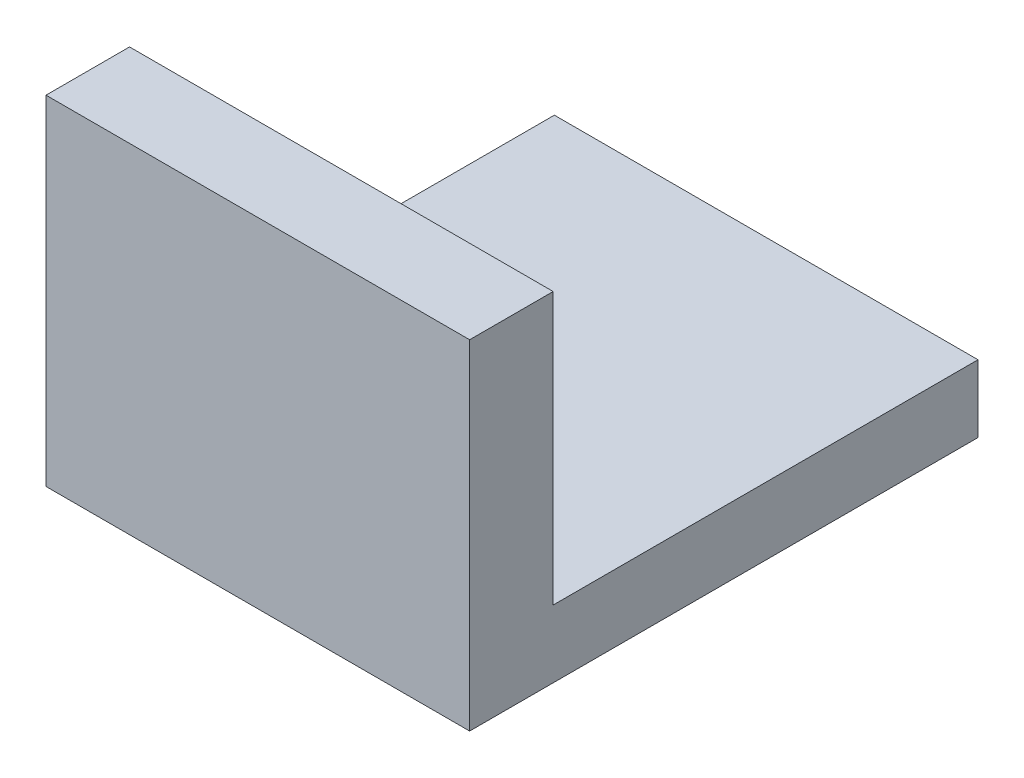
ISO-10303-21;
HEADER;
FILE_DESCRIPTION(('STEP AP214'),'2;1');
FILE_NAME('part.step','',(''),(''),'','','');
FILE_SCHEMA(('AUTOMOTIVE_DESIGN { 1 0 10303 214 1 1 1 1 }'));
ENDSEC;
DATA;
#1=APPLICATION_CONTEXT('core data for automotive mechanical design processes');
#2=APPLICATION_PROTOCOL_DEFINITION('international standard','automotive_design',2000,#1);
#3=PRODUCT_CONTEXT('',#1,'mechanical');
#4=PRODUCT('Part','Part','',(#3));
#5=PRODUCT_RELATED_PRODUCT_CATEGORY('part','',(#4));
#6=PRODUCT_DEFINITION_FORMATION('','',#4);
#7=PRODUCT_DEFINITION_CONTEXT('part definition',#1,'design');
#8=PRODUCT_DEFINITION('design','',#6,#7);
#9=PRODUCT_DEFINITION_SHAPE('','',#8);
#10=(LENGTH_UNIT() NAMED_UNIT(*) SI_UNIT(.MILLI.,.METRE.));
#11=(NAMED_UNIT(*) PLANE_ANGLE_UNIT() SI_UNIT($,.RADIAN.));
#12=(NAMED_UNIT(*) SI_UNIT($,.STERADIAN.) SOLID_ANGLE_UNIT());
#13=UNCERTAINTY_MEASURE_WITH_UNIT(LENGTH_MEASURE(1.E-05),#10,'distance_accuracy_value','');
#14=(GEOMETRIC_REPRESENTATION_CONTEXT(3) GLOBAL_UNCERTAINTY_ASSIGNED_CONTEXT((#13)) GLOBAL_UNIT_ASSIGNED_CONTEXT((#10,
#11,#12)) REPRESENTATION_CONTEXT('',''));
#15=CARTESIAN_POINT('',(0.,0.,0.));
#16=DIRECTION('',(0.,0.,1.));
#17=DIRECTION('',(1.,0.,0.));
#18=AXIS2_PLACEMENT_3D('',#15,#16,#17);
#19=CARTESIAN_POINT('',(127.,0.,0.));
#20=DIRECTION('',(0.,1.,0.));
#21=DIRECTION('',(0.,0.,1.));
#22=AXIS2_PLACEMENT_3D('',#19,#20,#21);
#23=PLANE('',#22);
#24=DIRECTION('',(0.,0.,-1.));
#25=VECTOR('',#24,1.);
#26=CARTESIAN_POINT('',(0.,0.,0.));
#27=LINE('',#26,#25);
#28=CARTESIAN_POINT('',(0.,0.,0.));
#29=VERTEX_POINT('',#28);
#30=CARTESIAN_POINT('',(0.,0.,-152.4));
#31=VERTEX_POINT('',#30);
#32=EDGE_CURVE('E117',#29,#31,#27,.T.);
#33=ORIENTED_EDGE('',*,*,#32,.T.);
#34=DIRECTION('',(-1.,0.,0.));
#35=VECTOR('',#34,1.);
#36=CARTESIAN_POINT('',(127.,0.,-152.4));
#37=LINE('',#36,#35);
#38=CARTESIAN_POINT('',(127.,0.,-152.4));
#39=VERTEX_POINT('',#38);
#40=EDGE_CURVE('E11',#39,#31,#37,.T.);
#41=ORIENTED_EDGE('',*,*,#40,.F.);
#42=DIRECTION('',(0.,0.,-1.));
#43=VECTOR('',#42,1.);
#44=CARTESIAN_POINT('',(127.,0.,0.));
#45=LINE('',#44,#43);
#46=CARTESIAN_POINT('',(127.,0.,0.));
#47=VERTEX_POINT('',#46);
#48=EDGE_CURVE('E127',#47,#39,#45,.T.);
#49=ORIENTED_EDGE('',*,*,#48,.F.);
#50=DIRECTION('',(-1.,0.,0.));
#51=VECTOR('',#50,1.);
#52=CARTESIAN_POINT('',(127.,0.,0.));
#53=LINE('',#52,#51);
#54=EDGE_CURVE('E113',#47,#29,#53,.T.);
#55=ORIENTED_EDGE('',*,*,#54,.T.);
#56=EDGE_LOOP('',(#33,#41,#49,#55));
#57=FACE_BOUND('',#56,.T.);
#58=ADVANCED_FACE('F33',(#57),#23,.F.);
#59=CARTESIAN_POINT('',(127.,0.,-152.4));
#60=DIRECTION('',(0.,0.,1.));
#61=DIRECTION('',(1.,0.,0.));
#62=AXIS2_PLACEMENT_3D('',#59,#60,#61);
#63=PLANE('',#62);
#64=DIRECTION('',(0.,1.,0.));
#65=VECTOR('',#64,1.);
#66=CARTESIAN_POINT('',(0.,0.,-152.4));
#67=LINE('',#66,#65);
#68=CARTESIAN_POINT('',(0.,20.2063995162138,-152.4));
#69=VERTEX_POINT('',#68);
#70=EDGE_CURVE('E120',#31,#69,#67,.T.);
#71=ORIENTED_EDGE('',*,*,#70,.T.);
#72=DIRECTION('',(-1.,0.,0.));
#73=VECTOR('',#72,1.);
#74=CARTESIAN_POINT('',(127.,20.2063995162138,-152.4));
#75=LINE('',#74,#73);
#76=CARTESIAN_POINT('',(127.,20.2063995162138,-152.4));
#77=VERTEX_POINT('',#76);
#78=EDGE_CURVE('E41',#77,#69,#75,.T.);
#79=ORIENTED_EDGE('',*,*,#78,.F.);
#80=DIRECTION('',(0.,1.,0.));
#81=VECTOR('',#80,1.);
#82=CARTESIAN_POINT('',(127.,0.,-152.4));
#83=LINE('',#82,#81);
#84=EDGE_CURVE('E86',#39,#77,#83,.T.);
#85=ORIENTED_EDGE('',*,*,#84,.F.);
#86=ORIENTED_EDGE('',*,*,#40,.T.);
#87=EDGE_LOOP('',(#71,#79,#85,#86));
#88=FACE_BOUND('',#87,.T.);
#89=ADVANCED_FACE('F151',(#88),#63,.F.);
#90=CARTESIAN_POINT('',(127.,20.2063995162138,-152.4));
#91=DIRECTION('',(0.,-1.,0.));
#92=DIRECTION('',(0.,0.,-1.));
#93=AXIS2_PLACEMENT_3D('',#90,#91,#92);
#94=PLANE('',#93);
#95=DIRECTION('',(0.,0.,1.));
#96=VECTOR('',#95,1.);
#97=CARTESIAN_POINT('',(0.,20.2063995162138,-152.4));
#98=LINE('',#97,#96);
#99=CARTESIAN_POINT('',(0.,20.2063995162138,-25.0446142397926));
#100=VERTEX_POINT('',#99);
#101=EDGE_CURVE('E122',#69,#100,#98,.T.);
#102=ORIENTED_EDGE('',*,*,#101,.T.);
#103=DIRECTION('',(-1.,0.,0.));
#104=VECTOR('',#103,1.);
#105=CARTESIAN_POINT('',(127.,20.2063995162138,-25.0446142397926));
#106=LINE('',#105,#104);
#107=CARTESIAN_POINT('',(127.,20.2063995162138,-25.0446142397926));
#108=VERTEX_POINT('',#107);
#109=EDGE_CURVE('E108',#108,#100,#106,.T.);
#110=ORIENTED_EDGE('',*,*,#109,.F.);
#111=DIRECTION('',(0.,0.,1.));
#112=VECTOR('',#111,1.);
#113=CARTESIAN_POINT('',(127.,20.2063995162138,-152.4));
#114=LINE('',#113,#112);
#115=EDGE_CURVE('E99',#77,#108,#114,.T.);
#116=ORIENTED_EDGE('',*,*,#115,.F.);
#117=ORIENTED_EDGE('',*,*,#78,.T.);
#118=EDGE_LOOP('',(#102,#110,#116,#117));
#119=FACE_BOUND('',#118,.T.);
#120=ADVANCED_FACE('F133',(#119),#94,.F.);
#121=CARTESIAN_POINT('',(127.,20.2063995162138,-25.0446142397926));
#122=DIRECTION('',(0.,0.,1.));
#123=DIRECTION('',(1.,0.,0.));
#124=AXIS2_PLACEMENT_3D('',#121,#122,#123);
#125=PLANE('',#124);
#126=DIRECTION('',(0.,1.,0.));
#127=VECTOR('',#126,1.);
#128=CARTESIAN_POINT('',(0.,20.2063995162138,-25.0446142397926));
#129=LINE('',#128,#127);
#130=CARTESIAN_POINT('',(0.,101.6,-25.0446142397926));
#131=VERTEX_POINT('',#130);
#132=EDGE_CURVE('E107',#100,#131,#129,.T.);
#133=ORIENTED_EDGE('',*,*,#132,.T.);
#134=DIRECTION('',(-1.,0.,0.));
#135=VECTOR('',#134,1.);
#136=CARTESIAN_POINT('',(127.,101.6,-25.0446142397926));
#137=LINE('',#136,#135);
#138=CARTESIAN_POINT('',(127.,101.6,-25.0446142397926));
#139=VERTEX_POINT('',#138);
#140=EDGE_CURVE('E104',#139,#131,#137,.T.);
#141=ORIENTED_EDGE('',*,*,#140,.F.);
#142=DIRECTION('',(0.,1.,0.));
#143=VECTOR('',#142,1.);
#144=CARTESIAN_POINT('',(127.,20.2063995162138,-25.0446142397926));
#145=LINE('',#144,#143);
#146=EDGE_CURVE('E93',#108,#139,#145,.T.);
#147=ORIENTED_EDGE('',*,*,#146,.F.);
#148=ORIENTED_EDGE('',*,*,#109,.T.);
#149=EDGE_LOOP('',(#133,#141,#147,#148));
#150=FACE_BOUND('',#149,.T.);
#151=ADVANCED_FACE('F105',(#150),#125,.F.);
#152=CARTESIAN_POINT('',(127.,101.6,-25.0446142397926));
#153=DIRECTION('',(0.,-1.,0.));
#154=DIRECTION('',(0.,0.,-1.));
#155=AXIS2_PLACEMENT_3D('',#152,#153,#154);
#156=PLANE('',#155);
#157=DIRECTION('',(0.,0.,1.));
#158=VECTOR('',#157,1.);
#159=CARTESIAN_POINT('',(0.,101.6,-25.0446142397926));
#160=LINE('',#159,#158);
#161=CARTESIAN_POINT('',(0.,101.6,0.));
#162=VERTEX_POINT('',#161);
#163=EDGE_CURVE('E72',#131,#162,#160,.T.);
#164=ORIENTED_EDGE('',*,*,#163,.T.);
#165=DIRECTION('',(-1.,0.,0.));
#166=VECTOR('',#165,1.);
#167=CARTESIAN_POINT('',(127.,101.6,0.));
#168=LINE('',#167,#166);
#169=CARTESIAN_POINT('',(127.,101.6,0.));
#170=VERTEX_POINT('',#169);
#171=EDGE_CURVE('E109',#170,#162,#168,.T.);
#172=ORIENTED_EDGE('',*,*,#171,.F.);
#173=DIRECTION('',(0.,0.,1.));
#174=VECTOR('',#173,1.);
#175=CARTESIAN_POINT('',(127.,101.6,-25.0446142397926));
#176=LINE('',#175,#174);
#177=EDGE_CURVE('E97',#139,#170,#176,.T.);
#178=ORIENTED_EDGE('',*,*,#177,.F.);
#179=ORIENTED_EDGE('',*,*,#140,.T.);
#180=EDGE_LOOP('',(#164,#172,#178,#179));
#181=FACE_BOUND('',#180,.T.);
#182=ADVANCED_FACE('F111',(#181),#156,.F.);
#183=CARTESIAN_POINT('',(127.,0.,0.));
#184=DIRECTION('',(0.,0.,-1.));
#185=DIRECTION('',(-1.,0.,0.));
#186=AXIS2_PLACEMENT_3D('',#183,#184,#185);
#187=PLANE('',#186);
#188=DIRECTION('',(0.,-1.,0.));
#189=VECTOR('',#188,1.);
#190=CARTESIAN_POINT('',(0.,0.,0.));
#191=LINE('',#190,#189);
#192=EDGE_CURVE('E78',#162,#29,#191,.T.);
#193=ORIENTED_EDGE('',*,*,#192,.T.);
#194=ORIENTED_EDGE('',*,*,#54,.F.);
#195=DIRECTION('',(0.,-1.,0.));
#196=VECTOR('',#195,1.);
#197=CARTESIAN_POINT('',(127.,0.,0.));
#198=LINE('',#197,#196);
#199=EDGE_CURVE('E49',#170,#47,#198,.T.);
#200=ORIENTED_EDGE('',*,*,#199,.F.);
#201=ORIENTED_EDGE('',*,*,#171,.T.);
#202=EDGE_LOOP('',(#193,#194,#200,#201));
#203=FACE_BOUND('',#202,.T.);
#204=ADVANCED_FACE('F140',(#203),#187,.F.);
#205=CARTESIAN_POINT('',(127.,0.,0.));
#206=DIRECTION('',(1.,0.,0.));
#207=DIRECTION('',(0.,0.,-1.));
#208=AXIS2_PLACEMENT_3D('',#205,#206,#207);
#209=PLANE('',#208);
#210=ORIENTED_EDGE('',*,*,#48,.T.);
#211=ORIENTED_EDGE('',*,*,#84,.T.);
#212=ORIENTED_EDGE('',*,*,#115,.T.);
#213=ORIENTED_EDGE('',*,*,#146,.T.);
#214=ORIENTED_EDGE('',*,*,#177,.T.);
#215=ORIENTED_EDGE('',*,*,#199,.T.);
#216=EDGE_LOOP('',(#210,#211,#212,#213,#214,#215));
#217=FACE_BOUND('',#216,.T.);
#218=ADVANCED_FACE('F95',(#217),#209,.T.);
#219=CARTESIAN_POINT('',(0.,0.,0.));
#220=DIRECTION('',(1.,0.,0.));
#221=DIRECTION('',(0.,0.,-1.));
#222=AXIS2_PLACEMENT_3D('',#219,#220,#221);
#223=PLANE('',#222);
#224=ORIENTED_EDGE('',*,*,#32,.F.);
#225=ORIENTED_EDGE('',*,*,#192,.F.);
#226=ORIENTED_EDGE('',*,*,#163,.F.);
#227=ORIENTED_EDGE('',*,*,#132,.F.);
#228=ORIENTED_EDGE('',*,*,#101,.F.);
#229=ORIENTED_EDGE('',*,*,#70,.F.);
#230=EDGE_LOOP('',(#224,#225,#226,#227,#228,#229));
#231=FACE_BOUND('',#230,.T.);
#232=ADVANCED_FACE('F136',(#231),#223,.F.);
#233=CLOSED_SHELL('',(#58,#89,#120,#151,#182,#204,#218,#232));
#234=MANIFOLD_SOLID_BREP('B2',#233);
#235=ADVANCED_BREP_SHAPE_REPRESENTATION('',(#18,#234),#14);
#236=SHAPE_DEFINITION_REPRESENTATION(#9,#235);
ENDSEC;
END-ISO-10303-21;
